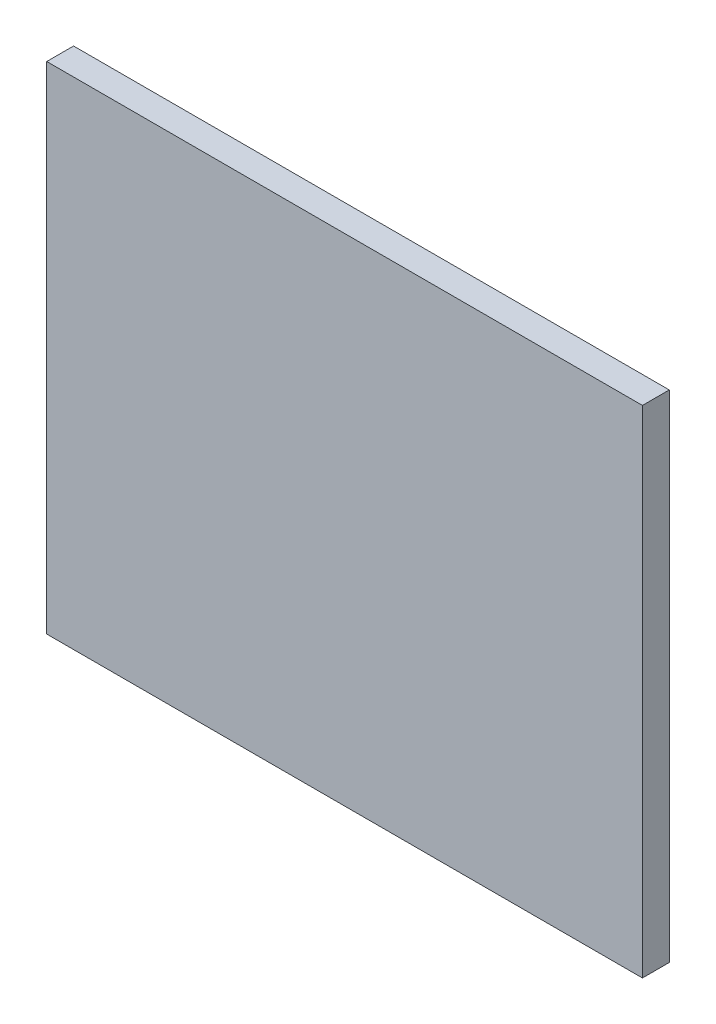
ISO-10303-21;
HEADER;
FILE_DESCRIPTION(('STEP AP214'),'2;1');
FILE_NAME('part.step','',(''),(''),'','','');
FILE_SCHEMA(('AUTOMOTIVE_DESIGN { 1 0 10303 214 1 1 1 1 }'));
ENDSEC;
DATA;
#1=APPLICATION_CONTEXT('core data for automotive mechanical design processes');
#2=APPLICATION_PROTOCOL_DEFINITION('international standard','automotive_design',2000,#1);
#3=PRODUCT_CONTEXT('',#1,'mechanical');
#4=PRODUCT('Part','Part','',(#3));
#5=PRODUCT_RELATED_PRODUCT_CATEGORY('part','',(#4));
#6=PRODUCT_DEFINITION_FORMATION('','',#4);
#7=PRODUCT_DEFINITION_CONTEXT('part definition',#1,'design');
#8=PRODUCT_DEFINITION('design','',#6,#7);
#9=PRODUCT_DEFINITION_SHAPE('','',#8);
#10=(LENGTH_UNIT() NAMED_UNIT(*) SI_UNIT(.MILLI.,.METRE.));
#11=(NAMED_UNIT(*) PLANE_ANGLE_UNIT() SI_UNIT($,.RADIAN.));
#12=(NAMED_UNIT(*) SI_UNIT($,.STERADIAN.) SOLID_ANGLE_UNIT());
#13=UNCERTAINTY_MEASURE_WITH_UNIT(LENGTH_MEASURE(1.E-05),#10,'distance_accuracy_value','');
#14=(GEOMETRIC_REPRESENTATION_CONTEXT(3) GLOBAL_UNCERTAINTY_ASSIGNED_CONTEXT((#13)) GLOBAL_UNIT_ASSIGNED_CONTEXT((#10,
#11,#12)) REPRESENTATION_CONTEXT('',''));
#15=CARTESIAN_POINT('',(0.,0.,0.));
#16=DIRECTION('',(0.,0.,1.));
#17=DIRECTION('',(1.,0.,0.));
#18=AXIS2_PLACEMENT_3D('',#15,#16,#17);
#19=CARTESIAN_POINT('',(0.,0.,5.));
#20=DIRECTION('',(1.,0.,0.));
#21=DIRECTION('',(0.,0.,-1.));
#22=AXIS2_PLACEMENT_3D('',#19,#20,#21);
#23=PLANE('',#22);
#24=DIRECTION('',(0.,-1.,0.));
#25=VECTOR('',#24,1.);
#26=CARTESIAN_POINT('',(0.,0.,0.));
#27=LINE('',#26,#25);
#28=CARTESIAN_POINT('',(0.,92.4,0.));
#29=VERTEX_POINT('',#28);
#30=CARTESIAN_POINT('',(0.,0.,0.));
#31=VERTEX_POINT('',#30);
#32=EDGE_CURVE('E109',#29,#31,#27,.T.);
#33=ORIENTED_EDGE('',*,*,#32,.T.);
#34=DIRECTION('',(0.,0.,-1.));
#35=VECTOR('',#34,1.);
#36=CARTESIAN_POINT('',(0.,0.,5.));
#37=LINE('',#36,#35);
#38=CARTESIAN_POINT('',(0.,0.,5.));
#39=VERTEX_POINT('',#38);
#40=EDGE_CURVE('E11',#39,#31,#37,.T.);
#41=ORIENTED_EDGE('',*,*,#40,.F.);
#42=DIRECTION('',(0.,-1.,0.));
#43=VECTOR('',#42,1.);
#44=CARTESIAN_POINT('',(0.,0.,5.));
#45=LINE('',#44,#43);
#46=CARTESIAN_POINT('',(0.,92.4,5.));
#47=VERTEX_POINT('',#46);
#48=EDGE_CURVE('E93',#47,#39,#45,.T.);
#49=ORIENTED_EDGE('',*,*,#48,.F.);
#50=DIRECTION('',(0.,0.,-1.));
#51=VECTOR('',#50,1.);
#52=CARTESIAN_POINT('',(0.,92.4,5.));
#53=LINE('',#52,#51);
#54=EDGE_CURVE('E105',#47,#29,#53,.T.);
#55=ORIENTED_EDGE('',*,*,#54,.T.);
#56=EDGE_LOOP('',(#33,#41,#49,#55));
#57=FACE_BOUND('',#56,.T.);
#58=ADVANCED_FACE('F41',(#57),#23,.F.);
#59=CARTESIAN_POINT('',(0.,0.,5.));
#60=DIRECTION('',(0.,1.,0.));
#61=DIRECTION('',(0.,0.,1.));
#62=AXIS2_PLACEMENT_3D('',#59,#60,#61);
#63=PLANE('',#62);
#64=DIRECTION('',(1.,0.,0.));
#65=VECTOR('',#64,1.);
#66=CARTESIAN_POINT('',(0.,0.,0.));
#67=LINE('',#66,#65);
#68=CARTESIAN_POINT('',(111.,0.,0.));
#69=VERTEX_POINT('',#68);
#70=EDGE_CURVE('E98',#31,#69,#67,.T.);
#71=ORIENTED_EDGE('',*,*,#70,.T.);
#72=DIRECTION('',(0.,0.,-1.));
#73=VECTOR('',#72,1.);
#74=CARTESIAN_POINT('',(111.,0.,5.));
#75=LINE('',#74,#73);
#76=CARTESIAN_POINT('',(111.,0.,5.));
#77=VERTEX_POINT('',#76);
#78=EDGE_CURVE('E50',#77,#69,#75,.T.);
#79=ORIENTED_EDGE('',*,*,#78,.F.);
#80=DIRECTION('',(1.,0.,0.));
#81=VECTOR('',#80,1.);
#82=CARTESIAN_POINT('',(0.,0.,5.));
#83=LINE('',#82,#81);
#84=EDGE_CURVE('E88',#39,#77,#83,.T.);
#85=ORIENTED_EDGE('',*,*,#84,.F.);
#86=ORIENTED_EDGE('',*,*,#40,.T.);
#87=EDGE_LOOP('',(#71,#79,#85,#86));
#88=FACE_BOUND('',#87,.T.);
#89=ADVANCED_FACE('F97',(#88),#63,.F.);
#90=CARTESIAN_POINT('',(111.,0.,5.));
#91=DIRECTION('',(-1.,0.,0.));
#92=DIRECTION('',(0.,0.,1.));
#93=AXIS2_PLACEMENT_3D('',#90,#91,#92);
#94=PLANE('',#93);
#95=DIRECTION('',(0.,1.,0.));
#96=VECTOR('',#95,1.);
#97=CARTESIAN_POINT('',(111.,0.,0.));
#98=LINE('',#97,#96);
#99=CARTESIAN_POINT('',(111.,92.4,0.));
#100=VERTEX_POINT('',#99);
#101=EDGE_CURVE('E75',#69,#100,#98,.T.);
#102=ORIENTED_EDGE('',*,*,#101,.T.);
#103=DIRECTION('',(0.,0.,-1.));
#104=VECTOR('',#103,1.);
#105=CARTESIAN_POINT('',(111.,92.4,5.));
#106=LINE('',#105,#104);
#107=CARTESIAN_POINT('',(111.,92.4,5.));
#108=VERTEX_POINT('',#107);
#109=EDGE_CURVE('E100',#108,#100,#106,.T.);
#110=ORIENTED_EDGE('',*,*,#109,.F.);
#111=DIRECTION('',(0.,1.,0.));
#112=VECTOR('',#111,1.);
#113=CARTESIAN_POINT('',(111.,0.,5.));
#114=LINE('',#113,#112);
#115=EDGE_CURVE('E91',#77,#108,#114,.T.);
#116=ORIENTED_EDGE('',*,*,#115,.F.);
#117=ORIENTED_EDGE('',*,*,#78,.T.);
#118=EDGE_LOOP('',(#102,#110,#116,#117));
#119=FACE_BOUND('',#118,.T.);
#120=ADVANCED_FACE('F101',(#119),#94,.F.);
#121=CARTESIAN_POINT('',(0.,92.4,5.));
#122=DIRECTION('',(0.,-1.,0.));
#123=DIRECTION('',(0.,0.,-1.));
#124=AXIS2_PLACEMENT_3D('',#121,#122,#123);
#125=PLANE('',#124);
#126=DIRECTION('',(-1.,0.,0.));
#127=VECTOR('',#126,1.);
#128=CARTESIAN_POINT('',(0.,92.4,0.));
#129=LINE('',#128,#127);
#130=EDGE_CURVE('E81',#100,#29,#129,.T.);
#131=ORIENTED_EDGE('',*,*,#130,.T.);
#132=ORIENTED_EDGE('',*,*,#54,.F.);
#133=DIRECTION('',(-1.,0.,0.));
#134=VECTOR('',#133,1.);
#135=CARTESIAN_POINT('',(0.,92.4,5.));
#136=LINE('',#135,#134);
#137=EDGE_CURVE('E58',#108,#47,#136,.T.);
#138=ORIENTED_EDGE('',*,*,#137,.F.);
#139=ORIENTED_EDGE('',*,*,#109,.T.);
#140=EDGE_LOOP('',(#131,#132,#138,#139));
#141=FACE_BOUND('',#140,.T.);
#142=ADVANCED_FACE('F122',(#141),#125,.F.);
#143=CARTESIAN_POINT('',(0.,0.,5.));
#144=DIRECTION('',(0.,0.,-1.));
#145=DIRECTION('',(-1.,0.,0.));
#146=AXIS2_PLACEMENT_3D('',#143,#144,#145);
#147=PLANE('',#146);
#148=ORIENTED_EDGE('',*,*,#48,.T.);
#149=ORIENTED_EDGE('',*,*,#84,.T.);
#150=ORIENTED_EDGE('',*,*,#115,.T.);
#151=ORIENTED_EDGE('',*,*,#137,.T.);
#152=EDGE_LOOP('',(#148,#149,#150,#151));
#153=FACE_BOUND('',#152,.T.);
#154=ADVANCED_FACE('F89',(#153),#147,.F.);
#155=CARTESIAN_POINT('',(0.,0.,0.));
#156=DIRECTION('',(0.,0.,-1.));
#157=DIRECTION('',(-1.,0.,0.));
#158=AXIS2_PLACEMENT_3D('',#155,#156,#157);
#159=PLANE('',#158);
#160=ORIENTED_EDGE('',*,*,#32,.F.);
#161=ORIENTED_EDGE('',*,*,#130,.F.);
#162=ORIENTED_EDGE('',*,*,#101,.F.);
#163=ORIENTED_EDGE('',*,*,#70,.F.);
#164=EDGE_LOOP('',(#160,#161,#162,#163));
#165=FACE_BOUND('',#164,.T.);
#166=ADVANCED_FACE('F125',(#165),#159,.T.);
#167=CLOSED_SHELL('',(#58,#89,#120,#142,#154,#166));
#168=MANIFOLD_SOLID_BREP('B2',#167);
#169=ADVANCED_BREP_SHAPE_REPRESENTATION('',(#18,#168),#14);
#170=SHAPE_DEFINITION_REPRESENTATION(#9,#169);
ENDSEC;
END-ISO-10303-21;
